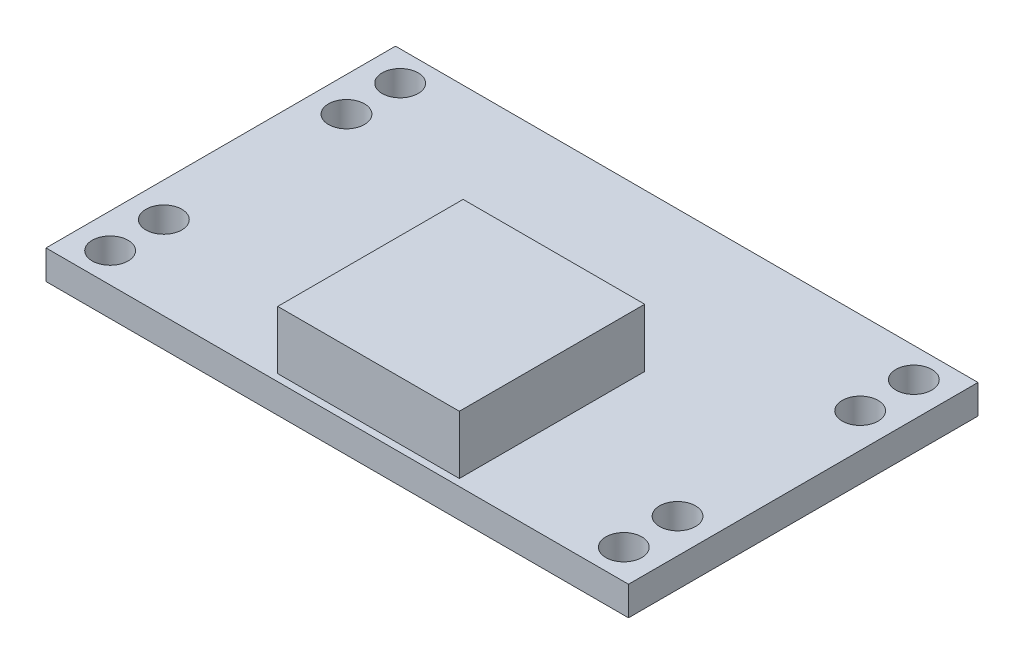
ISO-10303-21;
HEADER;
FILE_DESCRIPTION(('STEP AP214'),'2;1');
FILE_NAME('part.step','',(''),(''),'','','');
FILE_SCHEMA(('AUTOMOTIVE_DESIGN { 1 0 10303 214 1 1 1 1 }'));
ENDSEC;
DATA;
#1=APPLICATION_CONTEXT('core data for automotive mechanical design processes');
#2=APPLICATION_PROTOCOL_DEFINITION('international standard','automotive_design',2000,#1);
#3=PRODUCT_CONTEXT('',#1,'mechanical');
#4=PRODUCT('Part','Part','',(#3));
#5=PRODUCT_RELATED_PRODUCT_CATEGORY('part','',(#4));
#6=PRODUCT_DEFINITION_FORMATION('','',#4);
#7=PRODUCT_DEFINITION_CONTEXT('part definition',#1,'design');
#8=PRODUCT_DEFINITION('design','',#6,#7);
#9=PRODUCT_DEFINITION_SHAPE('','',#8);
#10=(LENGTH_UNIT() NAMED_UNIT(*) SI_UNIT(.MILLI.,.METRE.));
#11=(NAMED_UNIT(*) PLANE_ANGLE_UNIT() SI_UNIT($,.RADIAN.));
#12=(NAMED_UNIT(*) SI_UNIT($,.STERADIAN.) SOLID_ANGLE_UNIT());
#13=UNCERTAINTY_MEASURE_WITH_UNIT(LENGTH_MEASURE(1.E-05),#10,'distance_accuracy_value','');
#14=(GEOMETRIC_REPRESENTATION_CONTEXT(3) GLOBAL_UNCERTAINTY_ASSIGNED_CONTEXT((#13)) GLOBAL_UNIT_ASSIGNED_CONTEXT((#10,
#11,#12)) REPRESENTATION_CONTEXT('',''));
#15=CARTESIAN_POINT('',(0.,0.,0.));
#16=DIRECTION('',(0.,0.,1.));
#17=DIRECTION('',(1.,0.,0.));
#18=AXIS2_PLACEMENT_3D('',#15,#16,#17);
#19=CARTESIAN_POINT('',(0.,1.5,0.));
#20=DIRECTION('',(0.,1.,0.));
#21=DIRECTION('',(0.,0.,1.));
#22=AXIS2_PLACEMENT_3D('',#19,#20,#21);
#23=PLANE('',#22);
#24=CARTESIAN_POINT('',(-13.2280242605517,1.5,7.46822033898305));
#25=DIRECTION('',(0.,-1.,0.));
#26=DIRECTION('',(0.,0.,-1.));
#27=AXIS2_PLACEMENT_3D('',#24,#25,#26);
#28=CIRCLE('',#27,0.926140640752204);
#29=CARTESIAN_POINT('',(-13.2280242605517,1.5,6.54207969823084));
#30=VERTEX_POINT('',#29);
#31=EDGE_CURVE('E264',#30,#30,#28,.T.);
#32=ORIENTED_EDGE('',*,*,#31,.T.);
#33=EDGE_LOOP('',(#32));
#34=FACE_BOUND('',#33,.T.);
#35=CARTESIAN_POINT('',(13.2280242605517,1.5,-7.46822033898305));
#36=DIRECTION('',(0.,-1.,0.));
#37=DIRECTION('',(0.,0.,1.));
#38=AXIS2_PLACEMENT_3D('',#35,#36,#37);
#39=CIRCLE('',#38,0.926140640752204);
#40=CARTESIAN_POINT('',(13.2280242605517,1.5,-6.54207969823084));
#41=VERTEX_POINT('',#40);
#42=EDGE_CURVE('E277',#41,#41,#39,.T.);
#43=ORIENTED_EDGE('',*,*,#42,.T.);
#44=EDGE_LOOP('',(#43));
#45=FACE_BOUND('',#44,.T.);
#46=CARTESIAN_POINT('',(13.2280242605517,1.5,-4.70221280602636));
#47=DIRECTION('',(0.,-1.,0.));
#48=DIRECTION('',(0.,0.,1.));
#49=AXIS2_PLACEMENT_3D('',#46,#47,#48);
#50=CIRCLE('',#49,0.926140640752204);
#51=CARTESIAN_POINT('',(13.2280242605517,1.5,-3.77607216527416));
#52=VERTEX_POINT('',#51);
#53=EDGE_CURVE('E270',#52,#52,#50,.T.);
#54=ORIENTED_EDGE('',*,*,#53,.T.);
#55=EDGE_LOOP('',(#54));
#56=FACE_BOUND('',#55,.T.);
#57=CARTESIAN_POINT('',(13.2280242605517,1.5,7.46822033898305));
#58=DIRECTION('',(0.,1.,0.));
#59=DIRECTION('',(0.,0.,-1.));
#60=AXIS2_PLACEMENT_3D('',#57,#58,#59);
#61=CIRCLE('',#60,0.926140640752204);
#62=CARTESIAN_POINT('',(13.2280242605517,1.5,6.54207969823084));
#63=VERTEX_POINT('',#62);
#64=EDGE_CURVE('E289',#63,#63,#61,.T.);
#65=ORIENTED_EDGE('',*,*,#64,.F.);
#66=EDGE_LOOP('',(#65));
#67=FACE_BOUND('',#66,.T.);
#68=CARTESIAN_POINT('',(13.2280242605517,1.5,4.70221280602636));
#69=DIRECTION('',(0.,1.,0.));
#70=DIRECTION('',(0.,0.,-1.));
#71=AXIS2_PLACEMENT_3D('',#68,#69,#70);
#72=CIRCLE('',#71,0.926140640752204);
#73=CARTESIAN_POINT('',(13.2280242605517,1.5,3.77607216527416));
#74=VERTEX_POINT('',#73);
#75=EDGE_CURVE('E276',#74,#74,#72,.T.);
#76=ORIENTED_EDGE('',*,*,#75,.F.);
#77=EDGE_LOOP('',(#76));
#78=FACE_BOUND('',#77,.T.);
#79=CARTESIAN_POINT('',(-13.2280242605517,1.5,-7.46822033898305));
#80=DIRECTION('',(0.,1.,0.));
#81=DIRECTION('',(0.,0.,1.));
#82=AXIS2_PLACEMENT_3D('',#79,#80,#81);
#83=CIRCLE('',#82,0.926140640752204);
#84=CARTESIAN_POINT('',(-13.2280242605517,1.5,-6.54207969823084));
#85=VERTEX_POINT('',#84);
#86=EDGE_CURVE('E301',#85,#85,#83,.T.);
#87=ORIENTED_EDGE('',*,*,#86,.F.);
#88=EDGE_LOOP('',(#87));
#89=FACE_BOUND('',#88,.T.);
#90=CARTESIAN_POINT('',(-13.2280242605517,1.5,-4.70221280602636));
#91=DIRECTION('',(0.,1.,0.));
#92=DIRECTION('',(0.,0.,1.));
#93=AXIS2_PLACEMENT_3D('',#90,#91,#92);
#94=CIRCLE('',#93,0.926140640752204);
#95=CARTESIAN_POINT('',(-13.2280242605517,1.5,-3.77607216527416));
#96=VERTEX_POINT('',#95);
#97=EDGE_CURVE('E288',#96,#96,#94,.T.);
#98=ORIENTED_EDGE('',*,*,#97,.F.);
#99=EDGE_LOOP('',(#98));
#100=FACE_BOUND('',#99,.T.);
#101=DIRECTION('',(0.,0.,-1.));
#102=VECTOR('',#101,1.);
#103=CARTESIAN_POINT('',(5.92863567596198,1.5,-0.906244193175056));
#104=LINE('',#103,#102);
#105=CARTESIAN_POINT('',(5.92863567596198,1.5,8.64045036088274));
#106=VERTEX_POINT('',#105);
#107=CARTESIAN_POINT('',(5.92863567596198,1.5,-0.906244193175056));
#108=VERTEX_POINT('',#107);
#109=EDGE_CURVE('E51',#106,#108,#104,.T.);
#110=ORIENTED_EDGE('',*,*,#109,.F.);
#111=DIRECTION('',(1.,0.,0.));
#112=VECTOR('',#111,1.);
#113=CARTESIAN_POINT('',(-3.42435782917291,1.5,8.64045036088274));
#114=LINE('',#113,#112);
#115=CARTESIAN_POINT('',(-3.42435782917291,1.5,8.64045036088274));
#116=VERTEX_POINT('',#115);
#117=EDGE_CURVE('E55',#116,#106,#114,.T.);
#118=ORIENTED_EDGE('',*,*,#117,.F.);
#119=DIRECTION('',(0.,0.,1.));
#120=VECTOR('',#119,1.);
#121=CARTESIAN_POINT('',(-3.42435782917291,1.5,-0.906244193175056));
#122=LINE('',#121,#120);
#123=CARTESIAN_POINT('',(-3.42435782917291,1.5,-0.906244193175056));
#124=VERTEX_POINT('',#123);
#125=EDGE_CURVE('E319',#124,#116,#122,.T.);
#126=ORIENTED_EDGE('',*,*,#125,.F.);
#127=DIRECTION('',(-1.,0.,0.));
#128=VECTOR('',#127,1.);
#129=CARTESIAN_POINT('',(-3.42435782917291,1.5,-0.906244193175056));
#130=LINE('',#129,#128);
#131=EDGE_CURVE('E316',#108,#124,#130,.T.);
#132=ORIENTED_EDGE('',*,*,#131,.F.);
#133=EDGE_LOOP('',(#110,#118,#126,#132));
#134=FACE_BOUND('',#133,.T.);
#135=DIRECTION('',(0.,0.,1.));
#136=VECTOR('',#135,1.);
#137=CARTESIAN_POINT('',(-15.,1.5,9.));
#138=LINE('',#137,#136);
#139=CARTESIAN_POINT('',(-15.,1.5,-9.));
#140=VERTEX_POINT('',#139);
#141=CARTESIAN_POINT('',(-15.,1.5,9.));
#142=VERTEX_POINT('',#141);
#143=EDGE_CURVE('E136',#140,#142,#138,.T.);
#144=ORIENTED_EDGE('',*,*,#143,.T.);
#145=DIRECTION('',(1.,0.,0.));
#146=VECTOR('',#145,1.);
#147=CARTESIAN_POINT('',(15.,1.5,9.));
#148=LINE('',#147,#146);
#149=CARTESIAN_POINT('',(15.,1.5,9.));
#150=VERTEX_POINT('',#149);
#151=EDGE_CURVE('E140',#142,#150,#148,.T.);
#152=ORIENTED_EDGE('',*,*,#151,.T.);
#153=DIRECTION('',(0.,0.,-1.));
#154=VECTOR('',#153,1.);
#155=CARTESIAN_POINT('',(15.,1.5,9.));
#156=LINE('',#155,#154);
#157=CARTESIAN_POINT('',(15.,1.5,-9.));
#158=VERTEX_POINT('',#157);
#159=EDGE_CURVE('E143',#150,#158,#156,.T.);
#160=ORIENTED_EDGE('',*,*,#159,.T.);
#161=DIRECTION('',(-1.,0.,0.));
#162=VECTOR('',#161,1.);
#163=CARTESIAN_POINT('',(15.,1.5,-9.));
#164=LINE('',#163,#162);
#165=EDGE_CURVE('E145',#158,#140,#164,.T.);
#166=ORIENTED_EDGE('',*,*,#165,.T.);
#167=EDGE_LOOP('',(#144,#152,#160,#166));
#168=FACE_BOUND('',#167,.T.);
#169=CARTESIAN_POINT('',(-13.2280242605517,1.5,4.70221280602636));
#170=DIRECTION('',(0.,-1.,0.));
#171=DIRECTION('',(0.,0.,-1.));
#172=AXIS2_PLACEMENT_3D('',#169,#170,#171);
#173=CIRCLE('',#172,0.926140640752204);
#174=CARTESIAN_POINT('',(-13.2280242605517,1.5,3.77607216527416));
#175=VERTEX_POINT('',#174);
#176=EDGE_CURVE('E260',#175,#175,#173,.T.);
#177=ORIENTED_EDGE('',*,*,#176,.T.);
#178=EDGE_LOOP('',(#177));
#179=FACE_BOUND('',#178,.T.);
#180=ADVANCED_FACE('F36',(#34,#45,#56,#67,#78,#89,#100,#134,#168,#179),#23,.T.);
#181=CARTESIAN_POINT('',(0.,0.,0.));
#182=DIRECTION('',(0.,1.,0.));
#183=DIRECTION('',(0.,0.,1.));
#184=AXIS2_PLACEMENT_3D('',#181,#182,#183);
#185=PLANE('',#184);
#186=CARTESIAN_POINT('',(13.2280242605517,0.,-7.46822033898305));
#187=DIRECTION('',(0.,-1.,0.));
#188=DIRECTION('',(0.,0.,1.));
#189=AXIS2_PLACEMENT_3D('',#186,#187,#188);
#190=CIRCLE('',#189,0.926140640752204);
#191=CARTESIAN_POINT('',(13.2280242605517,0.,-6.54207969823084));
#192=VERTEX_POINT('',#191);
#193=EDGE_CURVE('E273',#192,#192,#190,.T.);
#194=ORIENTED_EDGE('',*,*,#193,.F.);
#195=EDGE_LOOP('',(#194));
#196=FACE_BOUND('',#195,.T.);
#197=CARTESIAN_POINT('',(13.2280242605517,0.,-4.70221280602636));
#198=DIRECTION('',(0.,-1.,0.));
#199=DIRECTION('',(0.,0.,1.));
#200=AXIS2_PLACEMENT_3D('',#197,#198,#199);
#201=CIRCLE('',#200,0.926140640752204);
#202=CARTESIAN_POINT('',(13.2280242605517,0.,-3.77607216527416));
#203=VERTEX_POINT('',#202);
#204=EDGE_CURVE('E280',#203,#203,#201,.T.);
#205=ORIENTED_EDGE('',*,*,#204,.F.);
#206=EDGE_LOOP('',(#205));
#207=FACE_BOUND('',#206,.T.);
#208=CARTESIAN_POINT('',(13.2280242605517,0.,7.46822033898305));
#209=DIRECTION('',(0.,1.,0.));
#210=DIRECTION('',(0.,0.,-1.));
#211=AXIS2_PLACEMENT_3D('',#208,#209,#210);
#212=CIRCLE('',#211,0.926140640752204);
#213=CARTESIAN_POINT('',(13.2280242605517,0.,6.54207969823084));
#214=VERTEX_POINT('',#213);
#215=EDGE_CURVE('E285',#214,#214,#212,.T.);
#216=ORIENTED_EDGE('',*,*,#215,.T.);
#217=EDGE_LOOP('',(#216));
#218=FACE_BOUND('',#217,.T.);
#219=CARTESIAN_POINT('',(13.2280242605517,0.,4.70221280602636));
#220=DIRECTION('',(0.,1.,0.));
#221=DIRECTION('',(0.,0.,-1.));
#222=AXIS2_PLACEMENT_3D('',#219,#220,#221);
#223=CIRCLE('',#222,0.926140640752204);
#224=CARTESIAN_POINT('',(13.2280242605517,0.,3.77607216527416));
#225=VERTEX_POINT('',#224);
#226=EDGE_CURVE('E292',#225,#225,#223,.T.);
#227=ORIENTED_EDGE('',*,*,#226,.T.);
#228=EDGE_LOOP('',(#227));
#229=FACE_BOUND('',#228,.T.);
#230=CARTESIAN_POINT('',(-13.2280242605517,0.,-7.46822033898305));
#231=DIRECTION('',(0.,1.,0.));
#232=DIRECTION('',(0.,0.,1.));
#233=AXIS2_PLACEMENT_3D('',#230,#231,#232);
#234=CIRCLE('',#233,0.926140640752204);
#235=CARTESIAN_POINT('',(-13.2280242605517,0.,-6.54207969823084));
#236=VERTEX_POINT('',#235);
#237=EDGE_CURVE('E297',#236,#236,#234,.T.);
#238=ORIENTED_EDGE('',*,*,#237,.T.);
#239=EDGE_LOOP('',(#238));
#240=FACE_BOUND('',#239,.T.);
#241=CARTESIAN_POINT('',(-13.2280242605517,0.,-4.70221280602636));
#242=DIRECTION('',(0.,1.,0.));
#243=DIRECTION('',(0.,0.,1.));
#244=AXIS2_PLACEMENT_3D('',#241,#242,#243);
#245=CIRCLE('',#244,0.926140640752204);
#246=CARTESIAN_POINT('',(-13.2280242605517,0.,-3.77607216527416));
#247=VERTEX_POINT('',#246);
#248=EDGE_CURVE('E305',#247,#247,#245,.T.);
#249=ORIENTED_EDGE('',*,*,#248,.T.);
#250=EDGE_LOOP('',(#249));
#251=FACE_BOUND('',#250,.T.);
#252=DIRECTION('',(0.,0.,1.));
#253=VECTOR('',#252,1.);
#254=CARTESIAN_POINT('',(-15.,0.,9.));
#255=LINE('',#254,#253);
#256=CARTESIAN_POINT('',(-15.,0.,-9.));
#257=VERTEX_POINT('',#256);
#258=CARTESIAN_POINT('',(-15.,0.,9.));
#259=VERTEX_POINT('',#258);
#260=EDGE_CURVE('E126',#257,#259,#255,.T.);
#261=ORIENTED_EDGE('',*,*,#260,.F.);
#262=DIRECTION('',(-1.,0.,0.));
#263=VECTOR('',#262,1.);
#264=CARTESIAN_POINT('',(15.,0.,-9.));
#265=LINE('',#264,#263);
#266=CARTESIAN_POINT('',(15.,0.,-9.));
#267=VERTEX_POINT('',#266);
#268=EDGE_CURVE('E141',#267,#257,#265,.T.);
#269=ORIENTED_EDGE('',*,*,#268,.F.);
#270=DIRECTION('',(0.,0.,-1.));
#271=VECTOR('',#270,1.);
#272=CARTESIAN_POINT('',(15.,0.,9.));
#273=LINE('',#272,#271);
#274=CARTESIAN_POINT('',(15.,0.,9.));
#275=VERTEX_POINT('',#274);
#276=EDGE_CURVE('E150',#275,#267,#273,.T.);
#277=ORIENTED_EDGE('',*,*,#276,.F.);
#278=DIRECTION('',(1.,0.,0.));
#279=VECTOR('',#278,1.);
#280=CARTESIAN_POINT('',(15.,0.,9.));
#281=LINE('',#280,#279);
#282=EDGE_CURVE('E129',#259,#275,#281,.T.);
#283=ORIENTED_EDGE('',*,*,#282,.F.);
#284=EDGE_LOOP('',(#261,#269,#277,#283));
#285=FACE_BOUND('',#284,.T.);
#286=CARTESIAN_POINT('',(-13.2280242605517,0.,7.46822033898305));
#287=DIRECTION('',(0.,-1.,0.));
#288=DIRECTION('',(0.,0.,-1.));
#289=AXIS2_PLACEMENT_3D('',#286,#287,#288);
#290=CIRCLE('',#289,0.926140640752204);
#291=CARTESIAN_POINT('',(-13.2280242605517,0.,6.54207969823084));
#292=VERTEX_POINT('',#291);
#293=EDGE_CURVE('E267',#292,#292,#290,.T.);
#294=ORIENTED_EDGE('',*,*,#293,.F.);
#295=EDGE_LOOP('',(#294));
#296=FACE_BOUND('',#295,.T.);
#297=CARTESIAN_POINT('',(-13.2280242605517,0.,4.70221280602636));
#298=DIRECTION('',(0.,-1.,0.));
#299=DIRECTION('',(0.,0.,-1.));
#300=AXIS2_PLACEMENT_3D('',#297,#298,#299);
#301=CIRCLE('',#300,0.926140640752204);
#302=CARTESIAN_POINT('',(-13.2280242605517,0.,3.77607216527416));
#303=VERTEX_POINT('',#302);
#304=EDGE_CURVE('E257',#303,#303,#301,.T.);
#305=ORIENTED_EDGE('',*,*,#304,.F.);
#306=EDGE_LOOP('',(#305));
#307=FACE_BOUND('',#306,.T.);
#308=ADVANCED_FACE('F170',(#196,#207,#218,#229,#240,#251,#285,#296,#307),#185,.F.);
#309=CARTESIAN_POINT('',(-15.,1.5,9.));
#310=DIRECTION('',(1.,0.,0.));
#311=DIRECTION('',(0.,0.,-1.));
#312=AXIS2_PLACEMENT_3D('',#309,#310,#311);
#313=PLANE('',#312);
#314=ORIENTED_EDGE('',*,*,#260,.T.);
#315=DIRECTION('',(0.,-1.,0.));
#316=VECTOR('',#315,1.);
#317=CARTESIAN_POINT('',(-15.,1.5,9.));
#318=LINE('',#317,#316);
#319=EDGE_CURVE('E11',#142,#259,#318,.T.);
#320=ORIENTED_EDGE('',*,*,#319,.F.);
#321=ORIENTED_EDGE('',*,*,#143,.F.);
#322=DIRECTION('',(0.,-1.,0.));
#323=VECTOR('',#322,1.);
#324=CARTESIAN_POINT('',(-15.,1.5,-9.));
#325=LINE('',#324,#323);
#326=EDGE_CURVE('E147',#140,#257,#325,.T.);
#327=ORIENTED_EDGE('',*,*,#326,.T.);
#328=EDGE_LOOP('',(#314,#320,#321,#327));
#329=FACE_BOUND('',#328,.T.);
#330=ADVANCED_FACE('F38',(#329),#313,.F.);
#331=CARTESIAN_POINT('',(15.,1.5,9.));
#332=DIRECTION('',(0.,0.,-1.));
#333=DIRECTION('',(-1.,0.,0.));
#334=AXIS2_PLACEMENT_3D('',#331,#332,#333);
#335=PLANE('',#334);
#336=ORIENTED_EDGE('',*,*,#282,.T.);
#337=DIRECTION('',(0.,-1.,0.));
#338=VECTOR('',#337,1.);
#339=CARTESIAN_POINT('',(15.,1.5,9.));
#340=LINE('',#339,#338);
#341=EDGE_CURVE('E44',#150,#275,#340,.T.);
#342=ORIENTED_EDGE('',*,*,#341,.F.);
#343=ORIENTED_EDGE('',*,*,#151,.F.);
#344=ORIENTED_EDGE('',*,*,#319,.T.);
#345=EDGE_LOOP('',(#336,#342,#343,#344));
#346=FACE_BOUND('',#345,.T.);
#347=ADVANCED_FACE('F181',(#346),#335,.F.);
#348=CARTESIAN_POINT('',(15.,1.5,9.));
#349=DIRECTION('',(-1.,0.,0.));
#350=DIRECTION('',(0.,0.,1.));
#351=AXIS2_PLACEMENT_3D('',#348,#349,#350);
#352=PLANE('',#351);
#353=ORIENTED_EDGE('',*,*,#276,.T.);
#354=DIRECTION('',(0.,-1.,0.));
#355=VECTOR('',#354,1.);
#356=CARTESIAN_POINT('',(15.,1.5,-9.));
#357=LINE('',#356,#355);
#358=EDGE_CURVE('E157',#158,#267,#357,.T.);
#359=ORIENTED_EDGE('',*,*,#358,.F.);
#360=ORIENTED_EDGE('',*,*,#159,.F.);
#361=ORIENTED_EDGE('',*,*,#341,.T.);
#362=EDGE_LOOP('',(#353,#359,#360,#361));
#363=FACE_BOUND('',#362,.T.);
#364=ADVANCED_FACE('F164',(#363),#352,.F.);
#365=CARTESIAN_POINT('',(15.,1.5,-9.));
#366=DIRECTION('',(0.,0.,1.));
#367=DIRECTION('',(1.,0.,0.));
#368=AXIS2_PLACEMENT_3D('',#365,#366,#367);
#369=PLANE('',#368);
#370=ORIENTED_EDGE('',*,*,#268,.T.);
#371=ORIENTED_EDGE('',*,*,#326,.F.);
#372=ORIENTED_EDGE('',*,*,#165,.F.);
#373=ORIENTED_EDGE('',*,*,#358,.T.);
#374=EDGE_LOOP('',(#370,#371,#372,#373));
#375=FACE_BOUND('',#374,.T.);
#376=ADVANCED_FACE('F174',(#375),#369,.F.);
#377=CARTESIAN_POINT('',(5.92863567596198,4.5,-0.906244193175056));
#378=DIRECTION('',(-1.,0.,0.));
#379=DIRECTION('',(0.,0.,1.));
#380=AXIS2_PLACEMENT_3D('',#377,#378,#379);
#381=PLANE('',#380);
#382=ORIENTED_EDGE('',*,*,#109,.T.);
#383=DIRECTION('',(0.,-1.,0.));
#384=VECTOR('',#383,1.);
#385=CARTESIAN_POINT('',(5.92863567596198,4.5,-0.906244193175056));
#386=LINE('',#385,#384);
#387=CARTESIAN_POINT('',(5.92863567596198,4.5,-0.906244193175056));
#388=VERTEX_POINT('',#387);
#389=EDGE_CURVE('E108',#388,#108,#386,.T.);
#390=ORIENTED_EDGE('',*,*,#389,.F.);
#391=DIRECTION('',(0.,0.,-1.));
#392=VECTOR('',#391,1.);
#393=CARTESIAN_POINT('',(5.92863567596198,4.5,-0.906244193175056));
#394=LINE('',#393,#392);
#395=CARTESIAN_POINT('',(5.92863567596198,4.5,8.64045036088274));
#396=VERTEX_POINT('',#395);
#397=EDGE_CURVE('E115',#396,#388,#394,.T.);
#398=ORIENTED_EDGE('',*,*,#397,.F.);
#399=DIRECTION('',(0.,-1.,0.));
#400=VECTOR('',#399,1.);
#401=CARTESIAN_POINT('',(5.92863567596198,4.5,8.64045036088274));
#402=LINE('',#401,#400);
#403=EDGE_CURVE('E314',#396,#106,#402,.T.);
#404=ORIENTED_EDGE('',*,*,#403,.T.);
#405=EDGE_LOOP('',(#382,#390,#398,#404));
#406=FACE_BOUND('',#405,.T.);
#407=ADVANCED_FACE('F125',(#406),#381,.F.);
#408=CARTESIAN_POINT('',(-3.42435782917291,4.5,-0.906244193175056));
#409=DIRECTION('',(0.,0.,1.));
#410=DIRECTION('',(1.,0.,0.));
#411=AXIS2_PLACEMENT_3D('',#408,#409,#410);
#412=PLANE('',#411);
#413=ORIENTED_EDGE('',*,*,#131,.T.);
#414=DIRECTION('',(0.,-1.,0.));
#415=VECTOR('',#414,1.);
#416=CARTESIAN_POINT('',(-3.42435782917291,4.5,-0.906244193175056));
#417=LINE('',#416,#415);
#418=CARTESIAN_POINT('',(-3.42435782917291,4.5,-0.906244193175056));
#419=VERTEX_POINT('',#418);
#420=EDGE_CURVE('E110',#419,#124,#417,.T.);
#421=ORIENTED_EDGE('',*,*,#420,.F.);
#422=DIRECTION('',(-1.,0.,0.));
#423=VECTOR('',#422,1.);
#424=CARTESIAN_POINT('',(-3.42435782917291,4.5,-0.906244193175056));
#425=LINE('',#424,#423);
#426=EDGE_CURVE('E103',#388,#419,#425,.T.);
#427=ORIENTED_EDGE('',*,*,#426,.F.);
#428=ORIENTED_EDGE('',*,*,#389,.T.);
#429=EDGE_LOOP('',(#413,#421,#427,#428));
#430=FACE_BOUND('',#429,.T.);
#431=ADVANCED_FACE('F106',(#430),#412,.F.);
#432=CARTESIAN_POINT('',(-3.42435782917291,4.5,-0.906244193175056));
#433=DIRECTION('',(1.,0.,0.));
#434=DIRECTION('',(0.,0.,-1.));
#435=AXIS2_PLACEMENT_3D('',#432,#433,#434);
#436=PLANE('',#435);
#437=ORIENTED_EDGE('',*,*,#125,.T.);
#438=DIRECTION('',(0.,-1.,0.));
#439=VECTOR('',#438,1.);
#440=CARTESIAN_POINT('',(-3.42435782917291,4.5,8.64045036088274));
#441=LINE('',#440,#439);
#442=CARTESIAN_POINT('',(-3.42435782917291,4.5,8.64045036088274));
#443=VERTEX_POINT('',#442);
#444=EDGE_CURVE('E132',#443,#116,#441,.T.);
#445=ORIENTED_EDGE('',*,*,#444,.F.);
#446=DIRECTION('',(0.,0.,1.));
#447=VECTOR('',#446,1.);
#448=CARTESIAN_POINT('',(-3.42435782917291,4.5,-0.906244193175056));
#449=LINE('',#448,#447);
#450=EDGE_CURVE('E114',#419,#443,#449,.T.);
#451=ORIENTED_EDGE('',*,*,#450,.F.);
#452=ORIENTED_EDGE('',*,*,#420,.T.);
#453=EDGE_LOOP('',(#437,#445,#451,#452));
#454=FACE_BOUND('',#453,.T.);
#455=ADVANCED_FACE('F208',(#454),#436,.F.);
#456=CARTESIAN_POINT('',(-3.42435782917291,4.5,8.64045036088274));
#457=DIRECTION('',(0.,0.,-1.));
#458=DIRECTION('',(-1.,0.,0.));
#459=AXIS2_PLACEMENT_3D('',#456,#457,#458);
#460=PLANE('',#459);
#461=ORIENTED_EDGE('',*,*,#117,.T.);
#462=ORIENTED_EDGE('',*,*,#403,.F.);
#463=DIRECTION('',(1.,0.,0.));
#464=VECTOR('',#463,1.);
#465=CARTESIAN_POINT('',(-3.42435782917291,4.5,8.64045036088274));
#466=LINE('',#465,#464);
#467=EDGE_CURVE('E120',#443,#396,#466,.T.);
#468=ORIENTED_EDGE('',*,*,#467,.F.);
#469=ORIENTED_EDGE('',*,*,#444,.T.);
#470=EDGE_LOOP('',(#461,#462,#468,#469));
#471=FACE_BOUND('',#470,.T.);
#472=ADVANCED_FACE('F212',(#471),#460,.F.);
#473=CARTESIAN_POINT('',(0.,4.5,0.));
#474=DIRECTION('',(0.,1.,0.));
#475=DIRECTION('',(0.,0.,1.));
#476=AXIS2_PLACEMENT_3D('',#473,#474,#475);
#477=PLANE('',#476);
#478=ORIENTED_EDGE('',*,*,#397,.T.);
#479=ORIENTED_EDGE('',*,*,#426,.T.);
#480=ORIENTED_EDGE('',*,*,#450,.T.);
#481=ORIENTED_EDGE('',*,*,#467,.T.);
#482=EDGE_LOOP('',(#478,#479,#480,#481));
#483=FACE_BOUND('',#482,.T.);
#484=ADVANCED_FACE('F118',(#483),#477,.T.);
#485=CARTESIAN_POINT('',(-13.2280242605517,0.,-4.70221280602636));
#486=DIRECTION('',(0.,1.,0.));
#487=DIRECTION('',(0.,0.,1.));
#488=AXIS2_PLACEMENT_3D('',#485,#486,#487);
#489=CYLINDRICAL_SURFACE('',#488,0.926140640752204);
#490=ORIENTED_EDGE('',*,*,#248,.F.);
#491=EDGE_LOOP('',(#490));
#492=FACE_BOUND('',#491,.T.);
#493=ORIENTED_EDGE('',*,*,#97,.T.);
#494=EDGE_LOOP('',(#493));
#495=FACE_BOUND('',#494,.T.);
#496=ADVANCED_FACE('F221',(#492,#495),#489,.F.);
#497=CARTESIAN_POINT('',(-13.2280242605517,0.,-7.46822033898305));
#498=DIRECTION('',(0.,1.,0.));
#499=DIRECTION('',(0.,0.,1.));
#500=AXIS2_PLACEMENT_3D('',#497,#498,#499);
#501=CYLINDRICAL_SURFACE('',#500,0.926140640752204);
#502=ORIENTED_EDGE('',*,*,#237,.F.);
#503=EDGE_LOOP('',(#502));
#504=FACE_BOUND('',#503,.T.);
#505=ORIENTED_EDGE('',*,*,#86,.T.);
#506=EDGE_LOOP('',(#505));
#507=FACE_BOUND('',#506,.T.);
#508=ADVANCED_FACE('F224',(#504,#507),#501,.F.);
#509=CARTESIAN_POINT('',(13.2280242605517,0.,4.70221280602636));
#510=DIRECTION('',(0.,1.,0.));
#511=DIRECTION('',(0.,0.,1.));
#512=AXIS2_PLACEMENT_3D('',#509,#510,#511);
#513=CYLINDRICAL_SURFACE('',#512,0.926140640752204);
#514=ORIENTED_EDGE('',*,*,#226,.F.);
#515=EDGE_LOOP('',(#514));
#516=FACE_BOUND('',#515,.T.);
#517=ORIENTED_EDGE('',*,*,#75,.T.);
#518=EDGE_LOOP('',(#517));
#519=FACE_BOUND('',#518,.T.);
#520=ADVANCED_FACE('F228',(#516,#519),#513,.F.);
#521=CARTESIAN_POINT('',(13.2280242605517,0.,7.46822033898305));
#522=DIRECTION('',(0.,1.,0.));
#523=DIRECTION('',(0.,0.,1.));
#524=AXIS2_PLACEMENT_3D('',#521,#522,#523);
#525=CYLINDRICAL_SURFACE('',#524,0.926140640752204);
#526=ORIENTED_EDGE('',*,*,#215,.F.);
#527=EDGE_LOOP('',(#526));
#528=FACE_BOUND('',#527,.T.);
#529=ORIENTED_EDGE('',*,*,#64,.T.);
#530=EDGE_LOOP('',(#529));
#531=FACE_BOUND('',#530,.T.);
#532=ADVANCED_FACE('F232',(#528,#531),#525,.F.);
#533=CARTESIAN_POINT('',(13.2280242605517,0.,-4.70221280602636));
#534=DIRECTION('',(0.,1.,0.));
#535=DIRECTION('',(0.,0.,1.));
#536=AXIS2_PLACEMENT_3D('',#533,#534,#535);
#537=CYLINDRICAL_SURFACE('',#536,0.926140640752204);
#538=ORIENTED_EDGE('',*,*,#204,.T.);
#539=EDGE_LOOP('',(#538));
#540=FACE_BOUND('',#539,.T.);
#541=ORIENTED_EDGE('',*,*,#53,.F.);
#542=EDGE_LOOP('',(#541));
#543=FACE_BOUND('',#542,.T.);
#544=ADVANCED_FACE('F236',(#540,#543),#537,.F.);
#545=CARTESIAN_POINT('',(13.2280242605517,0.,-7.46822033898305));
#546=DIRECTION('',(0.,1.,0.));
#547=DIRECTION('',(0.,0.,1.));
#548=AXIS2_PLACEMENT_3D('',#545,#546,#547);
#549=CYLINDRICAL_SURFACE('',#548,0.926140640752204);
#550=ORIENTED_EDGE('',*,*,#193,.T.);
#551=EDGE_LOOP('',(#550));
#552=FACE_BOUND('',#551,.T.);
#553=ORIENTED_EDGE('',*,*,#42,.F.);
#554=EDGE_LOOP('',(#553));
#555=FACE_BOUND('',#554,.T.);
#556=ADVANCED_FACE('F240',(#552,#555),#549,.F.);
#557=CARTESIAN_POINT('',(-13.2280242605517,0.,7.46822033898305));
#558=DIRECTION('',(0.,1.,0.));
#559=DIRECTION('',(0.,0.,1.));
#560=AXIS2_PLACEMENT_3D('',#557,#558,#559);
#561=CYLINDRICAL_SURFACE('',#560,0.926140640752204);
#562=ORIENTED_EDGE('',*,*,#293,.T.);
#563=EDGE_LOOP('',(#562));
#564=FACE_BOUND('',#563,.T.);
#565=ORIENTED_EDGE('',*,*,#31,.F.);
#566=EDGE_LOOP('',(#565));
#567=FACE_BOUND('',#566,.T.);
#568=ADVANCED_FACE('F244',(#564,#567),#561,.F.);
#569=CARTESIAN_POINT('',(-13.2280242605517,0.,4.70221280602636));
#570=DIRECTION('',(0.,1.,0.));
#571=DIRECTION('',(0.,0.,1.));
#572=AXIS2_PLACEMENT_3D('',#569,#570,#571);
#573=CYLINDRICAL_SURFACE('',#572,0.926140640752204);
#574=ORIENTED_EDGE('',*,*,#304,.T.);
#575=EDGE_LOOP('',(#574));
#576=FACE_BOUND('',#575,.T.);
#577=ORIENTED_EDGE('',*,*,#176,.F.);
#578=EDGE_LOOP('',(#577));
#579=FACE_BOUND('',#578,.T.);
#580=ADVANCED_FACE('F248',(#576,#579),#573,.F.);
#581=CLOSED_SHELL('',(#180,#308,#330,#347,#364,#376,#407,#431,#455,#472,#484,#496,#508,#520,
#532,#544,#556,#568,#580));
#582=MANIFOLD_SOLID_BREP('B2',#581);
#583=ADVANCED_BREP_SHAPE_REPRESENTATION('',(#18,#582),#14);
#584=SHAPE_DEFINITION_REPRESENTATION(#9,#583);
ENDSEC;
END-ISO-10303-21;
